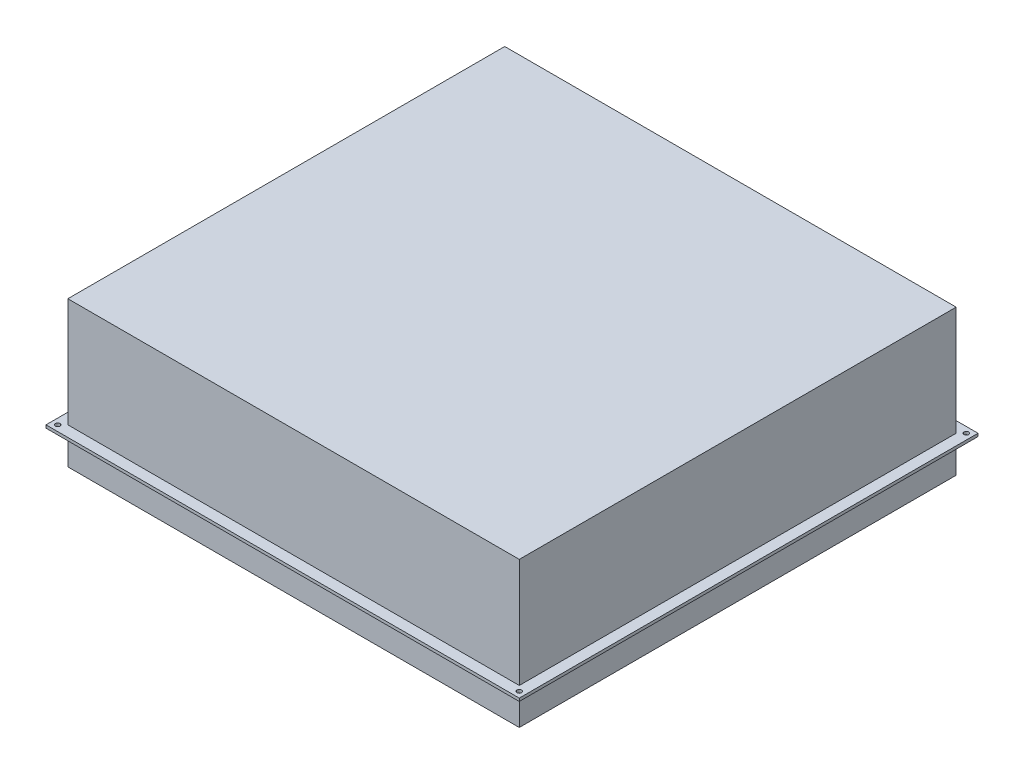
ISO-10303-21;
HEADER;
FILE_DESCRIPTION(('STEP AP214'),'2;1');
FILE_NAME('part.step','',(''),(''),'','','');
FILE_SCHEMA(('AUTOMOTIVE_DESIGN { 1 0 10303 214 1 1 1 1 }'));
ENDSEC;
DATA;
#1=APPLICATION_CONTEXT('core data for automotive mechanical design processes');
#2=APPLICATION_PROTOCOL_DEFINITION('international standard','automotive_design',2000,#1);
#3=PRODUCT_CONTEXT('',#1,'mechanical');
#4=PRODUCT('Part','Part','',(#3));
#5=PRODUCT_RELATED_PRODUCT_CATEGORY('part','',(#4));
#6=PRODUCT_DEFINITION_FORMATION('','',#4);
#7=PRODUCT_DEFINITION_CONTEXT('part definition',#1,'design');
#8=PRODUCT_DEFINITION('design','',#6,#7);
#9=PRODUCT_DEFINITION_SHAPE('','',#8);
#10=(LENGTH_UNIT() NAMED_UNIT(*) SI_UNIT(.MILLI.,.METRE.));
#11=(NAMED_UNIT(*) PLANE_ANGLE_UNIT() SI_UNIT($,.RADIAN.));
#12=(NAMED_UNIT(*) SI_UNIT($,.STERADIAN.) SOLID_ANGLE_UNIT());
#13=UNCERTAINTY_MEASURE_WITH_UNIT(LENGTH_MEASURE(1.E-05),#10,'distance_accuracy_value','');
#14=(GEOMETRIC_REPRESENTATION_CONTEXT(3) GLOBAL_UNCERTAINTY_ASSIGNED_CONTEXT((#13)) GLOBAL_UNIT_ASSIGNED_CONTEXT((#10,
#11,#12)) REPRESENTATION_CONTEXT('',''));
#15=CARTESIAN_POINT('',(0.,0.,0.));
#16=DIRECTION('',(0.,0.,1.));
#17=DIRECTION('',(1.,0.,0.));
#18=AXIS2_PLACEMENT_3D('',#15,#16,#17);
#19=CARTESIAN_POINT('',(-155.,-24.,150.));
#20=DIRECTION('',(1.,0.,0.));
#21=DIRECTION('',(0.,0.,-1.));
#22=AXIS2_PLACEMENT_3D('',#19,#20,#21);
#23=PLANE('',#22);
#24=DIRECTION('',(0.,0.,-1.));
#25=VECTOR('',#24,1.);
#26=CARTESIAN_POINT('',(-155.,-1.,150.));
#27=LINE('',#26,#25);
#28=CARTESIAN_POINT('',(-155.,-1.,150.));
#29=VERTEX_POINT('',#28);
#30=CARTESIAN_POINT('',(-155.,-1.,-150.));
#31=VERTEX_POINT('',#30);
#32=EDGE_CURVE('E112',#29,#31,#27,.T.);
#33=ORIENTED_EDGE('',*,*,#32,.T.);
#34=DIRECTION('',(0.,1.,0.));
#35=VECTOR('',#34,1.);
#36=CARTESIAN_POINT('',(-155.,-24.,-150.));
#37=LINE('',#36,#35);
#38=CARTESIAN_POINT('',(-155.,-24.,-150.));
#39=VERTEX_POINT('',#38);
#40=EDGE_CURVE('E12',#39,#31,#37,.T.);
#41=ORIENTED_EDGE('',*,*,#40,.F.);
#42=DIRECTION('',(0.,0.,-1.));
#43=VECTOR('',#42,1.);
#44=CARTESIAN_POINT('',(-155.,-24.,150.));
#45=LINE('',#44,#43);
#46=CARTESIAN_POINT('',(-155.,-24.,150.));
#47=VERTEX_POINT('',#46);
#48=EDGE_CURVE('E100',#47,#39,#45,.T.);
#49=ORIENTED_EDGE('',*,*,#48,.F.);
#50=DIRECTION('',(0.,1.,0.));
#51=VECTOR('',#50,1.);
#52=CARTESIAN_POINT('',(-155.,-24.,150.));
#53=LINE('',#52,#51);
#54=EDGE_CURVE('E108',#47,#29,#53,.T.);
#55=ORIENTED_EDGE('',*,*,#54,.T.);
#56=EDGE_LOOP('',(#33,#41,#49,#55));
#57=FACE_BOUND('',#56,.T.);
#58=ADVANCED_FACE('F49',(#57),#23,.F.);
#59=CARTESIAN_POINT('',(-155.,-24.,-150.));
#60=DIRECTION('',(0.,0.,1.));
#61=DIRECTION('',(1.,0.,0.));
#62=AXIS2_PLACEMENT_3D('',#59,#60,#61);
#63=PLANE('',#62);
#64=DIRECTION('',(1.,0.,0.));
#65=VECTOR('',#64,1.);
#66=CARTESIAN_POINT('',(-155.,-1.,-150.));
#67=LINE('',#66,#65);
#68=CARTESIAN_POINT('',(155.,-1.,-150.));
#69=VERTEX_POINT('',#68);
#70=EDGE_CURVE('E104',#31,#69,#67,.T.);
#71=ORIENTED_EDGE('',*,*,#70,.T.);
#72=DIRECTION('',(0.,1.,0.));
#73=VECTOR('',#72,1.);
#74=CARTESIAN_POINT('',(155.,-24.,-150.));
#75=LINE('',#74,#73);
#76=CARTESIAN_POINT('',(155.,-24.,-150.));
#77=VERTEX_POINT('',#76);
#78=EDGE_CURVE('E57',#77,#69,#75,.T.);
#79=ORIENTED_EDGE('',*,*,#78,.F.);
#80=DIRECTION('',(1.,0.,0.));
#81=VECTOR('',#80,1.);
#82=CARTESIAN_POINT('',(-155.,-24.,-150.));
#83=LINE('',#82,#81);
#84=EDGE_CURVE('E95',#39,#77,#83,.T.);
#85=ORIENTED_EDGE('',*,*,#84,.F.);
#86=ORIENTED_EDGE('',*,*,#40,.T.);
#87=EDGE_LOOP('',(#71,#79,#85,#86));
#88=FACE_BOUND('',#87,.T.);
#89=ADVANCED_FACE('F103',(#88),#63,.F.);
#90=CARTESIAN_POINT('',(155.,-24.,-150.));
#91=DIRECTION('',(-1.,0.,0.));
#92=DIRECTION('',(0.,0.,1.));
#93=AXIS2_PLACEMENT_3D('',#90,#91,#92);
#94=PLANE('',#93);
#95=DIRECTION('',(0.,0.,1.));
#96=VECTOR('',#95,1.);
#97=CARTESIAN_POINT('',(155.,-1.,-150.));
#98=LINE('',#97,#96);
#99=CARTESIAN_POINT('',(155.,-1.,150.));
#100=VERTEX_POINT('',#99);
#101=EDGE_CURVE('E82',#69,#100,#98,.T.);
#102=ORIENTED_EDGE('',*,*,#101,.T.);
#103=DIRECTION('',(0.,1.,0.));
#104=VECTOR('',#103,1.);
#105=CARTESIAN_POINT('',(155.,-24.,150.));
#106=LINE('',#105,#104);
#107=CARTESIAN_POINT('',(155.,-24.,150.));
#108=VERTEX_POINT('',#107);
#109=EDGE_CURVE('E105',#108,#100,#106,.T.);
#110=ORIENTED_EDGE('',*,*,#109,.F.);
#111=DIRECTION('',(0.,0.,1.));
#112=VECTOR('',#111,1.);
#113=CARTESIAN_POINT('',(155.,-24.,-150.));
#114=LINE('',#113,#112);
#115=EDGE_CURVE('E98',#77,#108,#114,.T.);
#116=ORIENTED_EDGE('',*,*,#115,.F.);
#117=ORIENTED_EDGE('',*,*,#78,.T.);
#118=EDGE_LOOP('',(#102,#110,#116,#117));
#119=FACE_BOUND('',#118,.T.);
#120=ADVANCED_FACE('F106',(#119),#94,.F.);
#121=CARTESIAN_POINT('',(155.,-24.,150.));
#122=DIRECTION('',(0.,0.,-1.));
#123=DIRECTION('',(-1.,0.,0.));
#124=AXIS2_PLACEMENT_3D('',#121,#122,#123);
#125=PLANE('',#124);
#126=DIRECTION('',(-1.,0.,0.));
#127=VECTOR('',#126,1.);
#128=CARTESIAN_POINT('',(155.,-1.,150.));
#129=LINE('',#128,#127);
#130=EDGE_CURVE('E88',#100,#29,#129,.T.);
#131=ORIENTED_EDGE('',*,*,#130,.T.);
#132=ORIENTED_EDGE('',*,*,#54,.F.);
#133=DIRECTION('',(-1.,0.,0.));
#134=VECTOR('',#133,1.);
#135=CARTESIAN_POINT('',(155.,-24.,150.));
#136=LINE('',#135,#134);
#137=EDGE_CURVE('E65',#108,#47,#136,.T.);
#138=ORIENTED_EDGE('',*,*,#137,.F.);
#139=ORIENTED_EDGE('',*,*,#109,.T.);
#140=EDGE_LOOP('',(#131,#132,#138,#139));
#141=FACE_BOUND('',#140,.T.);
#142=ADVANCED_FACE('F119',(#141),#125,.F.);
#143=CARTESIAN_POINT('',(0.,-24.,0.));
#144=DIRECTION('',(0.,-1.,0.));
#145=DIRECTION('',(0.,0.,-1.));
#146=AXIS2_PLACEMENT_3D('',#143,#144,#145);
#147=PLANE('',#146);
#148=ORIENTED_EDGE('',*,*,#48,.T.);
#149=ORIENTED_EDGE('',*,*,#84,.T.);
#150=ORIENTED_EDGE('',*,*,#115,.T.);
#151=ORIENTED_EDGE('',*,*,#137,.T.);
#152=EDGE_LOOP('',(#148,#149,#150,#151));
#153=FACE_BOUND('',#152,.T.);
#154=ADVANCED_FACE('F96',(#153),#147,.T.);
#155=CARTESIAN_POINT('',(0.,-1.,0.));
#156=DIRECTION('',(0.,-1.,0.));
#157=DIRECTION('',(0.,0.,-1.));
#158=AXIS2_PLACEMENT_3D('',#155,#156,#157);
#159=PLANE('',#158);
#160=ORIENTED_EDGE('',*,*,#32,.F.);
#161=ORIENTED_EDGE('',*,*,#130,.F.);
#162=ORIENTED_EDGE('',*,*,#101,.F.);
#163=ORIENTED_EDGE('',*,*,#70,.F.);
#164=EDGE_LOOP('',(#160,#161,#162,#163));
#165=FACE_BOUND('',#164,.T.);
#166=ADVANCED_FACE('F122',(#165),#159,.F.);
#167=CLOSED_SHELL('',(#58,#89,#120,#142,#154,#166));
#168=MANIFOLD_SOLID_BREP('B2',#167);
#169=CARTESIAN_POINT('',(-155.,76.,150.));
#170=DIRECTION('',(0.,0.,-1.));
#171=DIRECTION('',(-1.,0.,0.));
#172=AXIS2_PLACEMENT_3D('',#169,#170,#171);
#173=PLANE('',#172);
#174=DIRECTION('',(1.,0.,0.));
#175=VECTOR('',#174,1.);
#176=CARTESIAN_POINT('',(-155.,1.,150.));
#177=LINE('',#176,#175);
#178=CARTESIAN_POINT('',(-155.,1.,150.));
#179=VERTEX_POINT('',#178);
#180=CARTESIAN_POINT('',(155.,1.,150.));
#181=VERTEX_POINT('',#180);
#182=EDGE_CURVE('E246',#179,#181,#177,.T.);
#183=ORIENTED_EDGE('',*,*,#182,.T.);
#184=DIRECTION('',(0.,-1.,0.));
#185=VECTOR('',#184,1.);
#186=CARTESIAN_POINT('',(155.,76.,150.));
#187=LINE('',#186,#185);
#188=CARTESIAN_POINT('',(155.,76.,150.));
#189=VERTEX_POINT('',#188);
#190=EDGE_CURVE('E47',#189,#181,#187,.T.);
#191=ORIENTED_EDGE('',*,*,#190,.F.);
#192=DIRECTION('',(1.,0.,0.));
#193=VECTOR('',#192,1.);
#194=CARTESIAN_POINT('',(-155.,76.,150.));
#195=LINE('',#194,#193);
#196=CARTESIAN_POINT('',(-155.,76.,150.));
#197=VERTEX_POINT('',#196);
#198=EDGE_CURVE('E234',#197,#189,#195,.T.);
#199=ORIENTED_EDGE('',*,*,#198,.F.);
#200=DIRECTION('',(0.,-1.,0.));
#201=VECTOR('',#200,1.);
#202=CARTESIAN_POINT('',(-155.,76.,150.));
#203=LINE('',#202,#201);
#204=EDGE_CURVE('E242',#197,#179,#203,.T.);
#205=ORIENTED_EDGE('',*,*,#204,.T.);
#206=EDGE_LOOP('',(#183,#191,#199,#205));
#207=FACE_BOUND('',#206,.T.);
#208=ADVANCED_FACE('F183',(#207),#173,.F.);
#209=CARTESIAN_POINT('',(155.,76.,150.));
#210=DIRECTION('',(-1.,0.,0.));
#211=DIRECTION('',(0.,0.,1.));
#212=AXIS2_PLACEMENT_3D('',#209,#210,#211);
#213=PLANE('',#212);
#214=DIRECTION('',(0.,0.,-1.));
#215=VECTOR('',#214,1.);
#216=CARTESIAN_POINT('',(155.,1.,150.));
#217=LINE('',#216,#215);
#218=CARTESIAN_POINT('',(155.,1.,-150.));
#219=VERTEX_POINT('',#218);
#220=EDGE_CURVE('E238',#181,#219,#217,.T.);
#221=ORIENTED_EDGE('',*,*,#220,.T.);
#222=DIRECTION('',(0.,-1.,0.));
#223=VECTOR('',#222,1.);
#224=CARTESIAN_POINT('',(155.,76.,-150.));
#225=LINE('',#224,#223);
#226=CARTESIAN_POINT('',(155.,76.,-150.));
#227=VERTEX_POINT('',#226);
#228=EDGE_CURVE('E191',#227,#219,#225,.T.);
#229=ORIENTED_EDGE('',*,*,#228,.F.);
#230=DIRECTION('',(0.,0.,-1.));
#231=VECTOR('',#230,1.);
#232=CARTESIAN_POINT('',(155.,76.,150.));
#233=LINE('',#232,#231);
#234=EDGE_CURVE('E229',#189,#227,#233,.T.);
#235=ORIENTED_EDGE('',*,*,#234,.F.);
#236=ORIENTED_EDGE('',*,*,#190,.T.);
#237=EDGE_LOOP('',(#221,#229,#235,#236));
#238=FACE_BOUND('',#237,.T.);
#239=ADVANCED_FACE('F237',(#238),#213,.F.);
#240=CARTESIAN_POINT('',(155.,76.,-150.));
#241=DIRECTION('',(0.,0.,1.));
#242=DIRECTION('',(1.,0.,0.));
#243=AXIS2_PLACEMENT_3D('',#240,#241,#242);
#244=PLANE('',#243);
#245=DIRECTION('',(-1.,0.,0.));
#246=VECTOR('',#245,1.);
#247=CARTESIAN_POINT('',(155.,1.,-150.));
#248=LINE('',#247,#246);
#249=CARTESIAN_POINT('',(-155.,1.,-150.));
#250=VERTEX_POINT('',#249);
#251=EDGE_CURVE('E216',#219,#250,#248,.T.);
#252=ORIENTED_EDGE('',*,*,#251,.T.);
#253=DIRECTION('',(0.,-1.,0.));
#254=VECTOR('',#253,1.);
#255=CARTESIAN_POINT('',(-155.,76.,-150.));
#256=LINE('',#255,#254);
#257=CARTESIAN_POINT('',(-155.,76.,-150.));
#258=VERTEX_POINT('',#257);
#259=EDGE_CURVE('E239',#258,#250,#256,.T.);
#260=ORIENTED_EDGE('',*,*,#259,.F.);
#261=DIRECTION('',(-1.,0.,0.));
#262=VECTOR('',#261,1.);
#263=CARTESIAN_POINT('',(155.,76.,-150.));
#264=LINE('',#263,#262);
#265=EDGE_CURVE('E232',#227,#258,#264,.T.);
#266=ORIENTED_EDGE('',*,*,#265,.F.);
#267=ORIENTED_EDGE('',*,*,#228,.T.);
#268=EDGE_LOOP('',(#252,#260,#266,#267));
#269=FACE_BOUND('',#268,.T.);
#270=ADVANCED_FACE('F240',(#269),#244,.F.);
#271=CARTESIAN_POINT('',(-155.,76.,-150.));
#272=DIRECTION('',(1.,0.,0.));
#273=DIRECTION('',(0.,0.,-1.));
#274=AXIS2_PLACEMENT_3D('',#271,#272,#273);
#275=PLANE('',#274);
#276=DIRECTION('',(0.,0.,1.));
#277=VECTOR('',#276,1.);
#278=CARTESIAN_POINT('',(-155.,1.,-150.));
#279=LINE('',#278,#277);
#280=EDGE_CURVE('E222',#250,#179,#279,.T.);
#281=ORIENTED_EDGE('',*,*,#280,.T.);
#282=ORIENTED_EDGE('',*,*,#204,.F.);
#283=DIRECTION('',(0.,0.,1.));
#284=VECTOR('',#283,1.);
#285=CARTESIAN_POINT('',(-155.,76.,-150.));
#286=LINE('',#285,#284);
#287=EDGE_CURVE('E199',#258,#197,#286,.T.);
#288=ORIENTED_EDGE('',*,*,#287,.F.);
#289=ORIENTED_EDGE('',*,*,#259,.T.);
#290=EDGE_LOOP('',(#281,#282,#288,#289));
#291=FACE_BOUND('',#290,.T.);
#292=ADVANCED_FACE('F253',(#291),#275,.F.);
#293=CARTESIAN_POINT('',(0.,76.,0.));
#294=DIRECTION('',(0.,1.,0.));
#295=DIRECTION('',(0.,0.,1.));
#296=AXIS2_PLACEMENT_3D('',#293,#294,#295);
#297=PLANE('',#296);
#298=ORIENTED_EDGE('',*,*,#198,.T.);
#299=ORIENTED_EDGE('',*,*,#234,.T.);
#300=ORIENTED_EDGE('',*,*,#265,.T.);
#301=ORIENTED_EDGE('',*,*,#287,.T.);
#302=EDGE_LOOP('',(#298,#299,#300,#301));
#303=FACE_BOUND('',#302,.T.);
#304=ADVANCED_FACE('F230',(#303),#297,.T.);
#305=CARTESIAN_POINT('',(0.,1.,0.));
#306=DIRECTION('',(0.,1.,0.));
#307=DIRECTION('',(0.,0.,1.));
#308=AXIS2_PLACEMENT_3D('',#305,#306,#307);
#309=PLANE('',#308);
#310=ORIENTED_EDGE('',*,*,#182,.F.);
#311=ORIENTED_EDGE('',*,*,#280,.F.);
#312=ORIENTED_EDGE('',*,*,#251,.F.);
#313=ORIENTED_EDGE('',*,*,#220,.F.);
#314=EDGE_LOOP('',(#310,#311,#312,#313));
#315=FACE_BOUND('',#314,.T.);
#316=ADVANCED_FACE('F256',(#315),#309,.F.);
#317=CLOSED_SHELL('',(#208,#239,#270,#292,#304,#316));
#318=MANIFOLD_SOLID_BREP('B6',#317);
#319=CARTESIAN_POINT('',(162.5,1.,-157.5));
#320=DIRECTION('',(-1.,0.,0.));
#321=DIRECTION('',(0.,0.,1.));
#322=AXIS2_PLACEMENT_3D('',#319,#320,#321);
#323=PLANE('',#322);
#324=DIRECTION('',(0.,0.,-1.));
#325=VECTOR('',#324,1.);
#326=CARTESIAN_POINT('',(162.5,-1.,-157.5));
#327=LINE('',#326,#325);
#328=CARTESIAN_POINT('',(162.5,-1.,157.5));
#329=VERTEX_POINT('',#328);
#330=CARTESIAN_POINT('',(162.5,-1.,-157.5));
#331=VERTEX_POINT('',#330);
#332=EDGE_CURVE('E375',#329,#331,#327,.T.);
#333=ORIENTED_EDGE('',*,*,#332,.T.);
#334=DIRECTION('',(0.,-1.,0.));
#335=VECTOR('',#334,1.);
#336=CARTESIAN_POINT('',(162.5,1.,-157.5));
#337=LINE('',#336,#335);
#338=CARTESIAN_POINT('',(162.5,1.,-157.5));
#339=VERTEX_POINT('',#338);
#340=EDGE_CURVE('E181',#339,#331,#337,.T.);
#341=ORIENTED_EDGE('',*,*,#340,.F.);
#342=DIRECTION('',(0.,0.,-1.));
#343=VECTOR('',#342,1.);
#344=CARTESIAN_POINT('',(162.5,1.,-157.5));
#345=LINE('',#344,#343);
#346=CARTESIAN_POINT('',(162.5,1.,157.5));
#347=VERTEX_POINT('',#346);
#348=EDGE_CURVE('E362',#347,#339,#345,.T.);
#349=ORIENTED_EDGE('',*,*,#348,.F.);
#350=DIRECTION('',(0.,-1.,0.));
#351=VECTOR('',#350,1.);
#352=CARTESIAN_POINT('',(162.5,1.,157.5));
#353=LINE('',#352,#351);
#354=EDGE_CURVE('E371',#347,#329,#353,.T.);
#355=ORIENTED_EDGE('',*,*,#354,.T.);
#356=EDGE_LOOP('',(#333,#341,#349,#355));
#357=FACE_BOUND('',#356,.T.);
#358=ADVANCED_FACE('F309',(#357),#323,.F.);
#359=CARTESIAN_POINT('',(-162.5,1.,-157.5));
#360=DIRECTION('',(0.,0.,1.));
#361=DIRECTION('',(1.,0.,0.));
#362=AXIS2_PLACEMENT_3D('',#359,#360,#361);
#363=PLANE('',#362);
#364=DIRECTION('',(-1.,0.,0.));
#365=VECTOR('',#364,1.);
#366=CARTESIAN_POINT('',(-162.5,-1.,-157.5));
#367=LINE('',#366,#365);
#368=CARTESIAN_POINT('',(-162.5,-1.,-157.5));
#369=VERTEX_POINT('',#368);
#370=EDGE_CURVE('E366',#331,#369,#367,.T.);
#371=ORIENTED_EDGE('',*,*,#370,.T.);
#372=DIRECTION('',(0.,-1.,0.));
#373=VECTOR('',#372,1.);
#374=CARTESIAN_POINT('',(-162.5,1.,-157.5));
#375=LINE('',#374,#373);
#376=CARTESIAN_POINT('',(-162.5,1.,-157.5));
#377=VERTEX_POINT('',#376);
#378=EDGE_CURVE('E318',#377,#369,#375,.T.);
#379=ORIENTED_EDGE('',*,*,#378,.F.);
#380=DIRECTION('',(-1.,0.,0.));
#381=VECTOR('',#380,1.);
#382=CARTESIAN_POINT('',(-162.5,1.,-157.5));
#383=LINE('',#382,#381);
#384=EDGE_CURVE('E357',#339,#377,#383,.T.);
#385=ORIENTED_EDGE('',*,*,#384,.F.);
#386=ORIENTED_EDGE('',*,*,#340,.T.);
#387=EDGE_LOOP('',(#371,#379,#385,#386));
#388=FACE_BOUND('',#387,.T.);
#389=ADVANCED_FACE('F365',(#388),#363,.F.);
#390=CARTESIAN_POINT('',(-162.5,1.,-157.5));
#391=DIRECTION('',(1.,0.,0.));
#392=DIRECTION('',(0.,0.,-1.));
#393=AXIS2_PLACEMENT_3D('',#390,#391,#392);
#394=PLANE('',#393);
#395=DIRECTION('',(0.,0.,1.));
#396=VECTOR('',#395,1.);
#397=CARTESIAN_POINT('',(-162.5,-1.,-157.5));
#398=LINE('',#397,#396);
#399=CARTESIAN_POINT('',(-162.5,-1.,157.5));
#400=VERTEX_POINT('',#399);
#401=EDGE_CURVE('E344',#369,#400,#398,.T.);
#402=ORIENTED_EDGE('',*,*,#401,.T.);
#403=DIRECTION('',(0.,-1.,0.));
#404=VECTOR('',#403,1.);
#405=CARTESIAN_POINT('',(-162.5,1.,157.5));
#406=LINE('',#405,#404);
#407=CARTESIAN_POINT('',(-162.5,1.,157.5));
#408=VERTEX_POINT('',#407);
#409=EDGE_CURVE('E367',#408,#400,#406,.T.);
#410=ORIENTED_EDGE('',*,*,#409,.F.);
#411=DIRECTION('',(0.,0.,1.));
#412=VECTOR('',#411,1.);
#413=CARTESIAN_POINT('',(-162.5,1.,-157.5));
#414=LINE('',#413,#412);
#415=EDGE_CURVE('E360',#377,#408,#414,.T.);
#416=ORIENTED_EDGE('',*,*,#415,.F.);
#417=ORIENTED_EDGE('',*,*,#378,.T.);
#418=EDGE_LOOP('',(#402,#410,#416,#417));
#419=FACE_BOUND('',#418,.T.);
#420=ADVANCED_FACE('F369',(#419),#394,.F.);
#421=CARTESIAN_POINT('',(-162.5,1.,157.5));
#422=DIRECTION('',(0.,0.,-1.));
#423=DIRECTION('',(-1.,0.,0.));
#424=AXIS2_PLACEMENT_3D('',#421,#422,#423);
#425=PLANE('',#424);
#426=DIRECTION('',(1.,0.,0.));
#427=VECTOR('',#426,1.);
#428=CARTESIAN_POINT('',(-162.5,-1.,157.5));
#429=LINE('',#428,#427);
#430=EDGE_CURVE('E350',#400,#329,#429,.T.);
#431=ORIENTED_EDGE('',*,*,#430,.T.);
#432=ORIENTED_EDGE('',*,*,#354,.F.);
#433=DIRECTION('',(1.,0.,0.));
#434=VECTOR('',#433,1.);
#435=CARTESIAN_POINT('',(-162.5,1.,157.5));
#436=LINE('',#435,#434);
#437=EDGE_CURVE('E327',#408,#347,#436,.T.);
#438=ORIENTED_EDGE('',*,*,#437,.F.);
#439=ORIENTED_EDGE('',*,*,#409,.T.);
#440=EDGE_LOOP('',(#431,#432,#438,#439));
#441=FACE_BOUND('',#440,.T.);
#442=ADVANCED_FACE('F426',(#441),#425,.F.);
#443=CARTESIAN_POINT('',(0.,1.,0.));
#444=DIRECTION('',(0.,1.,0.));
#445=DIRECTION('',(0.,0.,1.));
#446=AXIS2_PLACEMENT_3D('',#443,#444,#445);
#447=PLANE('',#446);
#448=CARTESIAN_POINT('',(-158.5,1.,153.5));
#449=DIRECTION('',(0.,1.,0.));
#450=DIRECTION('',(0.,0.,-1.));
#451=AXIS2_PLACEMENT_3D('',#448,#449,#450);
#452=CIRCLE('',#451,1.59999999999999);
#453=CARTESIAN_POINT('',(-158.5,1.,151.9));
#454=VERTEX_POINT('',#453);
#455=EDGE_CURVE('E493',#454,#454,#452,.T.);
#456=ORIENTED_EDGE('',*,*,#455,.F.);
#457=EDGE_LOOP('',(#456));
#458=FACE_BOUND('',#457,.T.);
#459=CARTESIAN_POINT('',(158.5,1.,153.5));
#460=DIRECTION('',(0.,1.,0.));
#461=DIRECTION('',(0.,0.,1.));
#462=AXIS2_PLACEMENT_3D('',#459,#460,#461);
#463=CIRCLE('',#462,1.59999999999999);
#464=CARTESIAN_POINT('',(158.5,1.,155.1));
#465=VERTEX_POINT('',#464);
#466=EDGE_CURVE('E488',#465,#465,#463,.T.);
#467=ORIENTED_EDGE('',*,*,#466,.F.);
#468=EDGE_LOOP('',(#467));
#469=FACE_BOUND('',#468,.T.);
#470=CARTESIAN_POINT('',(158.5,1.,-153.5));
#471=DIRECTION('',(0.,1.,0.));
#472=DIRECTION('',(0.,0.,-1.));
#473=AXIS2_PLACEMENT_3D('',#470,#471,#472);
#474=CIRCLE('',#473,1.59999999999999);
#475=CARTESIAN_POINT('',(158.5,1.,-155.1));
#476=VERTEX_POINT('',#475);
#477=EDGE_CURVE('E481',#476,#476,#474,.T.);
#478=ORIENTED_EDGE('',*,*,#477,.F.);
#479=EDGE_LOOP('',(#478));
#480=FACE_BOUND('',#479,.T.);
#481=CARTESIAN_POINT('',(-158.5,1.,-153.5));
#482=DIRECTION('',(0.,1.,0.));
#483=DIRECTION('',(0.,0.,1.));
#484=AXIS2_PLACEMENT_3D('',#481,#482,#483);
#485=CIRCLE('',#484,1.59999999999999);
#486=CARTESIAN_POINT('',(-158.5,1.,-151.9));
#487=VERTEX_POINT('',#486);
#488=EDGE_CURVE('E387',#487,#487,#485,.T.);
#489=ORIENTED_EDGE('',*,*,#488,.F.);
#490=EDGE_LOOP('',(#489));
#491=FACE_BOUND('',#490,.T.);
#492=ORIENTED_EDGE('',*,*,#348,.T.);
#493=ORIENTED_EDGE('',*,*,#384,.T.);
#494=ORIENTED_EDGE('',*,*,#415,.T.);
#495=ORIENTED_EDGE('',*,*,#437,.T.);
#496=EDGE_LOOP('',(#492,#493,#494,#495));
#497=FACE_BOUND('',#496,.T.);
#498=ADVANCED_FACE('F358',(#458,#469,#480,#491,#497),#447,.T.);
#499=CARTESIAN_POINT('',(0.,-1.,0.));
#500=DIRECTION('',(0.,1.,0.));
#501=DIRECTION('',(0.,0.,1.));
#502=AXIS2_PLACEMENT_3D('',#499,#500,#501);
#503=PLANE('',#502);
#504=CARTESIAN_POINT('',(-158.5,-1.,153.5));
#505=DIRECTION('',(0.,1.,0.));
#506=DIRECTION('',(0.,0.,1.));
#507=AXIS2_PLACEMENT_3D('',#504,#505,#506);
#508=CIRCLE('',#507,1.59999999999999);
#509=CARTESIAN_POINT('',(-158.5,-1.,155.1));
#510=VERTEX_POINT('',#509);
#511=EDGE_CURVE('E312',#510,#510,#508,.T.);
#512=ORIENTED_EDGE('',*,*,#511,.T.);
#513=EDGE_LOOP('',(#512));
#514=FACE_BOUND('',#513,.T.);
#515=CARTESIAN_POINT('',(158.5,-1.,153.5));
#516=DIRECTION('',(0.,1.,0.));
#517=DIRECTION('',(0.,0.,1.));
#518=AXIS2_PLACEMENT_3D('',#515,#516,#517);
#519=CIRCLE('',#518,1.59999999999999);
#520=CARTESIAN_POINT('',(158.5,-1.,155.1));
#521=VERTEX_POINT('',#520);
#522=EDGE_CURVE('E389',#521,#521,#519,.T.);
#523=ORIENTED_EDGE('',*,*,#522,.T.);
#524=EDGE_LOOP('',(#523));
#525=FACE_BOUND('',#524,.T.);
#526=CARTESIAN_POINT('',(158.5,-1.,-153.5));
#527=DIRECTION('',(0.,1.,0.));
#528=DIRECTION('',(0.,0.,1.));
#529=AXIS2_PLACEMENT_3D('',#526,#527,#528);
#530=CIRCLE('',#529,1.59999999999999);
#531=CARTESIAN_POINT('',(158.5,-1.,-151.9));
#532=VERTEX_POINT('',#531);
#533=EDGE_CURVE('E386',#532,#532,#530,.T.);
#534=ORIENTED_EDGE('',*,*,#533,.T.);
#535=EDGE_LOOP('',(#534));
#536=FACE_BOUND('',#535,.T.);
#537=CARTESIAN_POINT('',(-158.5,-1.,-153.5));
#538=DIRECTION('',(0.,1.,0.));
#539=DIRECTION('',(0.,0.,1.));
#540=AXIS2_PLACEMENT_3D('',#537,#538,#539);
#541=CIRCLE('',#540,1.59999999999999);
#542=CARTESIAN_POINT('',(-158.5,-1.,-151.9));
#543=VERTEX_POINT('',#542);
#544=EDGE_CURVE('E383',#543,#543,#541,.T.);
#545=ORIENTED_EDGE('',*,*,#544,.T.);
#546=EDGE_LOOP('',(#545));
#547=FACE_BOUND('',#546,.T.);
#548=ORIENTED_EDGE('',*,*,#332,.F.);
#549=ORIENTED_EDGE('',*,*,#430,.F.);
#550=ORIENTED_EDGE('',*,*,#401,.F.);
#551=ORIENTED_EDGE('',*,*,#370,.F.);
#552=EDGE_LOOP('',(#548,#549,#550,#551));
#553=FACE_BOUND('',#552,.T.);
#554=ADVANCED_FACE('F396',(#514,#525,#536,#547,#553),#503,.F.);
#555=CARTESIAN_POINT('',(-158.5,-24.,-153.5));
#556=DIRECTION('',(0.,1.,0.));
#557=DIRECTION('',(0.,0.,1.));
#558=AXIS2_PLACEMENT_3D('',#555,#556,#557);
#559=CYLINDRICAL_SURFACE('',#558,1.59999999999999);
#560=ORIENTED_EDGE('',*,*,#488,.T.);
#561=EDGE_LOOP('',(#560));
#562=FACE_BOUND('',#561,.T.);
#563=ORIENTED_EDGE('',*,*,#544,.F.);
#564=EDGE_LOOP('',(#563));
#565=FACE_BOUND('',#564,.T.);
#566=ADVANCED_FACE('F419',(#562,#565),#559,.F.);
#567=CARTESIAN_POINT('',(158.5,-24.,-153.5));
#568=DIRECTION('',(0.,1.,0.));
#569=DIRECTION('',(0.,0.,1.));
#570=AXIS2_PLACEMENT_3D('',#567,#568,#569);
#571=CYLINDRICAL_SURFACE('',#570,1.59999999999999);
#572=ORIENTED_EDGE('',*,*,#477,.T.);
#573=EDGE_LOOP('',(#572));
#574=FACE_BOUND('',#573,.T.);
#575=ORIENTED_EDGE('',*,*,#533,.F.);
#576=EDGE_LOOP('',(#575));
#577=FACE_BOUND('',#576,.T.);
#578=ADVANCED_FACE('F406',(#574,#577),#571,.F.);
#579=CARTESIAN_POINT('',(158.5,-24.,153.5));
#580=DIRECTION('',(0.,1.,0.));
#581=DIRECTION('',(0.,0.,1.));
#582=AXIS2_PLACEMENT_3D('',#579,#580,#581);
#583=CYLINDRICAL_SURFACE('',#582,1.59999999999999);
#584=ORIENTED_EDGE('',*,*,#466,.T.);
#585=EDGE_LOOP('',(#584));
#586=FACE_BOUND('',#585,.T.);
#587=ORIENTED_EDGE('',*,*,#522,.F.);
#588=EDGE_LOOP('',(#587));
#589=FACE_BOUND('',#588,.T.);
#590=ADVANCED_FACE('F400',(#586,#589),#583,.F.);
#591=CARTESIAN_POINT('',(-158.5,-24.,153.5));
#592=DIRECTION('',(0.,1.,0.));
#593=DIRECTION('',(0.,0.,1.));
#594=AXIS2_PLACEMENT_3D('',#591,#592,#593);
#595=CYLINDRICAL_SURFACE('',#594,1.59999999999999);
#596=ORIENTED_EDGE('',*,*,#455,.T.);
#597=EDGE_LOOP('',(#596));
#598=FACE_BOUND('',#597,.T.);
#599=ORIENTED_EDGE('',*,*,#511,.F.);
#600=EDGE_LOOP('',(#599));
#601=FACE_BOUND('',#600,.T.);
#602=ADVANCED_FACE('F398',(#598,#601),#595,.F.);
#603=CLOSED_SHELL('',(#358,#389,#420,#442,#498,#554,#566,#578,#590,#602));
#604=MANIFOLD_SOLID_BREP('B41',#603);
#605=ADVANCED_BREP_SHAPE_REPRESENTATION('',(#18,#168,#318,#604),#14);
#606=SHAPE_DEFINITION_REPRESENTATION(#9,#605);
ENDSEC;
END-ISO-10303-21;
